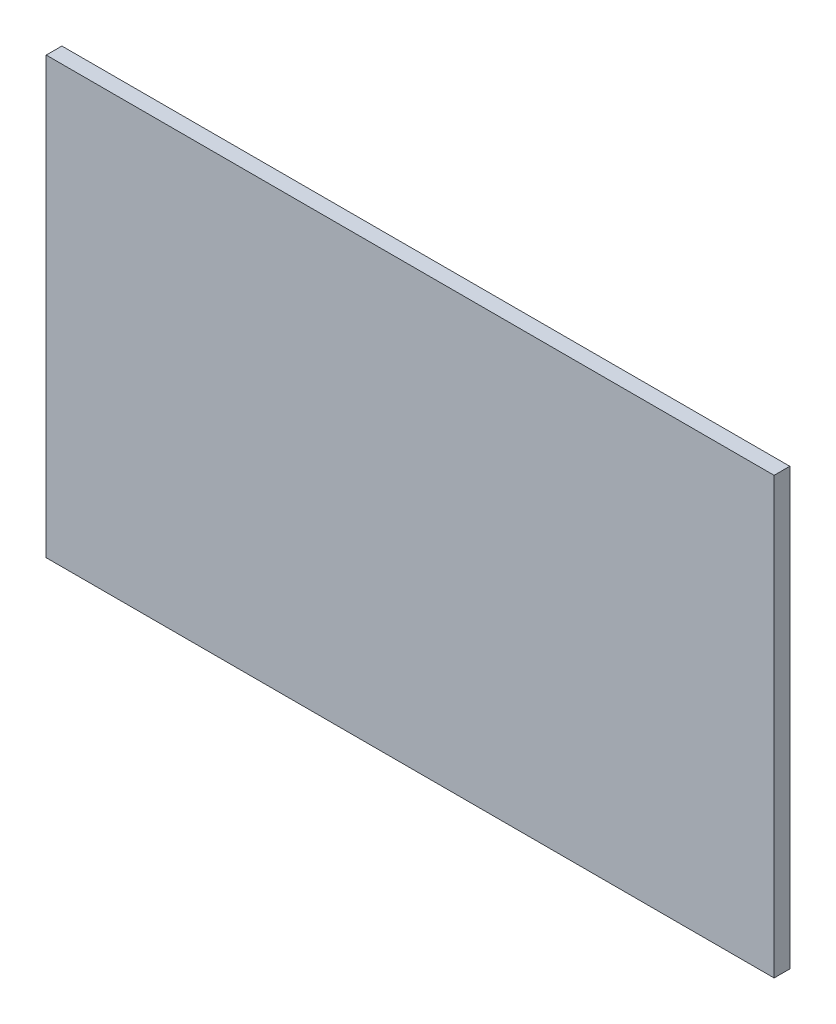
ISO-10303-21;
HEADER;
FILE_DESCRIPTION(('STEP AP214'),'2;1');
FILE_NAME('part.step','',(''),(''),'','','');
FILE_SCHEMA(('AUTOMOTIVE_DESIGN { 1 0 10303 214 1 1 1 1 }'));
ENDSEC;
DATA;
#1=APPLICATION_CONTEXT('core data for automotive mechanical design processes');
#2=APPLICATION_PROTOCOL_DEFINITION('international standard','automotive_design',2000,#1);
#3=PRODUCT_CONTEXT('',#1,'mechanical');
#4=PRODUCT('Part','Part','',(#3));
#5=PRODUCT_RELATED_PRODUCT_CATEGORY('part','',(#4));
#6=PRODUCT_DEFINITION_FORMATION('','',#4);
#7=PRODUCT_DEFINITION_CONTEXT('part definition',#1,'design');
#8=PRODUCT_DEFINITION('design','',#6,#7);
#9=PRODUCT_DEFINITION_SHAPE('','',#8);
#10=(LENGTH_UNIT() NAMED_UNIT(*) SI_UNIT(.MILLI.,.METRE.));
#11=(NAMED_UNIT(*) PLANE_ANGLE_UNIT() SI_UNIT($,.RADIAN.));
#12=(NAMED_UNIT(*) SI_UNIT($,.STERADIAN.) SOLID_ANGLE_UNIT());
#13=UNCERTAINTY_MEASURE_WITH_UNIT(LENGTH_MEASURE(1.E-05),#10,'distance_accuracy_value','');
#14=(GEOMETRIC_REPRESENTATION_CONTEXT(3) GLOBAL_UNCERTAINTY_ASSIGNED_CONTEXT((#13)) GLOBAL_UNIT_ASSIGNED_CONTEXT((#10,
#11,#12)) REPRESENTATION_CONTEXT('',''));
#15=CARTESIAN_POINT('',(0.,0.,0.));
#16=DIRECTION('',(0.,0.,1.));
#17=DIRECTION('',(1.,0.,0.));
#18=AXIS2_PLACEMENT_3D('',#15,#16,#17);
#19=CARTESIAN_POINT('',(0.,0.,9.));
#20=DIRECTION('',(1.,0.,0.));
#21=DIRECTION('',(0.,0.,-1.));
#22=AXIS2_PLACEMENT_3D('',#19,#20,#21);
#23=PLANE('',#22);
#24=DIRECTION('',(0.,-1.,0.));
#25=VECTOR('',#24,1.);
#26=CARTESIAN_POINT('',(0.,0.,0.));
#27=LINE('',#26,#25);
#28=CARTESIAN_POINT('',(0.,250.,0.));
#29=VERTEX_POINT('',#28);
#30=CARTESIAN_POINT('',(0.,0.,0.));
#31=VERTEX_POINT('',#30);
#32=EDGE_CURVE('E96',#29,#31,#27,.T.);
#33=ORIENTED_EDGE('',*,*,#32,.T.);
#34=DIRECTION('',(0.,0.,-1.));
#35=VECTOR('',#34,1.);
#36=CARTESIAN_POINT('',(0.,0.,9.));
#37=LINE('',#36,#35);
#38=CARTESIAN_POINT('',(0.,0.,9.));
#39=VERTEX_POINT('',#38);
#40=EDGE_CURVE('E11',#39,#31,#37,.T.);
#41=ORIENTED_EDGE('',*,*,#40,.F.);
#42=DIRECTION('',(0.,-1.,0.));
#43=VECTOR('',#42,1.);
#44=CARTESIAN_POINT('',(0.,0.,9.));
#45=LINE('',#44,#43);
#46=CARTESIAN_POINT('',(0.,250.,9.));
#47=VERTEX_POINT('',#46);
#48=EDGE_CURVE('E84',#47,#39,#45,.T.);
#49=ORIENTED_EDGE('',*,*,#48,.F.);
#50=DIRECTION('',(0.,0.,-1.));
#51=VECTOR('',#50,1.);
#52=CARTESIAN_POINT('',(0.,250.,9.));
#53=LINE('',#52,#51);
#54=EDGE_CURVE('E92',#47,#29,#53,.T.);
#55=ORIENTED_EDGE('',*,*,#54,.T.);
#56=EDGE_LOOP('',(#33,#41,#49,#55));
#57=FACE_BOUND('',#56,.T.);
#58=ADVANCED_FACE('F33',(#57),#23,.F.);
#59=CARTESIAN_POINT('',(0.,0.,9.));
#60=DIRECTION('',(0.,1.,0.));
#61=DIRECTION('',(0.,0.,1.));
#62=AXIS2_PLACEMENT_3D('',#59,#60,#61);
#63=PLANE('',#62);
#64=DIRECTION('',(1.,0.,0.));
#65=VECTOR('',#64,1.);
#66=CARTESIAN_POINT('',(0.,0.,0.));
#67=LINE('',#66,#65);
#68=CARTESIAN_POINT('',(418.,0.,0.));
#69=VERTEX_POINT('',#68);
#70=EDGE_CURVE('E88',#31,#69,#67,.T.);
#71=ORIENTED_EDGE('',*,*,#70,.T.);
#72=DIRECTION('',(0.,0.,-1.));
#73=VECTOR('',#72,1.);
#74=CARTESIAN_POINT('',(418.,0.,9.));
#75=LINE('',#74,#73);
#76=CARTESIAN_POINT('',(418.,0.,9.));
#77=VERTEX_POINT('',#76);
#78=EDGE_CURVE('E41',#77,#69,#75,.T.);
#79=ORIENTED_EDGE('',*,*,#78,.F.);
#80=DIRECTION('',(1.,0.,0.));
#81=VECTOR('',#80,1.);
#82=CARTESIAN_POINT('',(0.,0.,9.));
#83=LINE('',#82,#81);
#84=EDGE_CURVE('E79',#39,#77,#83,.T.);
#85=ORIENTED_EDGE('',*,*,#84,.F.);
#86=ORIENTED_EDGE('',*,*,#40,.T.);
#87=EDGE_LOOP('',(#71,#79,#85,#86));
#88=FACE_BOUND('',#87,.T.);
#89=ADVANCED_FACE('F87',(#88),#63,.F.);
#90=CARTESIAN_POINT('',(418.,0.,9.));
#91=DIRECTION('',(-1.,0.,0.));
#92=DIRECTION('',(0.,0.,1.));
#93=AXIS2_PLACEMENT_3D('',#90,#91,#92);
#94=PLANE('',#93);
#95=DIRECTION('',(0.,1.,0.));
#96=VECTOR('',#95,1.);
#97=CARTESIAN_POINT('',(418.,0.,0.));
#98=LINE('',#97,#96);
#99=CARTESIAN_POINT('',(418.,250.,0.));
#100=VERTEX_POINT('',#99);
#101=EDGE_CURVE('E66',#69,#100,#98,.T.);
#102=ORIENTED_EDGE('',*,*,#101,.T.);
#103=DIRECTION('',(0.,0.,-1.));
#104=VECTOR('',#103,1.);
#105=CARTESIAN_POINT('',(418.,250.,9.));
#106=LINE('',#105,#104);
#107=CARTESIAN_POINT('',(418.,250.,9.));
#108=VERTEX_POINT('',#107);
#109=EDGE_CURVE('E89',#108,#100,#106,.T.);
#110=ORIENTED_EDGE('',*,*,#109,.F.);
#111=DIRECTION('',(0.,1.,0.));
#112=VECTOR('',#111,1.);
#113=CARTESIAN_POINT('',(418.,0.,9.));
#114=LINE('',#113,#112);
#115=EDGE_CURVE('E82',#77,#108,#114,.T.);
#116=ORIENTED_EDGE('',*,*,#115,.F.);
#117=ORIENTED_EDGE('',*,*,#78,.T.);
#118=EDGE_LOOP('',(#102,#110,#116,#117));
#119=FACE_BOUND('',#118,.T.);
#120=ADVANCED_FACE('F90',(#119),#94,.F.);
#121=CARTESIAN_POINT('',(0.,250.,9.));
#122=DIRECTION('',(0.,-1.,0.));
#123=DIRECTION('',(0.,0.,-1.));
#124=AXIS2_PLACEMENT_3D('',#121,#122,#123);
#125=PLANE('',#124);
#126=DIRECTION('',(-1.,0.,0.));
#127=VECTOR('',#126,1.);
#128=CARTESIAN_POINT('',(0.,250.,0.));
#129=LINE('',#128,#127);
#130=EDGE_CURVE('E72',#100,#29,#129,.T.);
#131=ORIENTED_EDGE('',*,*,#130,.T.);
#132=ORIENTED_EDGE('',*,*,#54,.F.);
#133=DIRECTION('',(-1.,0.,0.));
#134=VECTOR('',#133,1.);
#135=CARTESIAN_POINT('',(0.,250.,9.));
#136=LINE('',#135,#134);
#137=EDGE_CURVE('E49',#108,#47,#136,.T.);
#138=ORIENTED_EDGE('',*,*,#137,.F.);
#139=ORIENTED_EDGE('',*,*,#109,.T.);
#140=EDGE_LOOP('',(#131,#132,#138,#139));
#141=FACE_BOUND('',#140,.T.);
#142=ADVANCED_FACE('F103',(#141),#125,.F.);
#143=CARTESIAN_POINT('',(0.,0.,9.));
#144=DIRECTION('',(0.,0.,-1.));
#145=DIRECTION('',(-1.,0.,0.));
#146=AXIS2_PLACEMENT_3D('',#143,#144,#145);
#147=PLANE('',#146);
#148=ORIENTED_EDGE('',*,*,#48,.T.);
#149=ORIENTED_EDGE('',*,*,#84,.T.);
#150=ORIENTED_EDGE('',*,*,#115,.T.);
#151=ORIENTED_EDGE('',*,*,#137,.T.);
#152=EDGE_LOOP('',(#148,#149,#150,#151));
#153=FACE_BOUND('',#152,.T.);
#154=ADVANCED_FACE('F80',(#153),#147,.F.);
#155=CARTESIAN_POINT('',(0.,0.,0.));
#156=DIRECTION('',(0.,0.,-1.));
#157=DIRECTION('',(-1.,0.,0.));
#158=AXIS2_PLACEMENT_3D('',#155,#156,#157);
#159=PLANE('',#158);
#160=ORIENTED_EDGE('',*,*,#32,.F.);
#161=ORIENTED_EDGE('',*,*,#130,.F.);
#162=ORIENTED_EDGE('',*,*,#101,.F.);
#163=ORIENTED_EDGE('',*,*,#70,.F.);
#164=EDGE_LOOP('',(#160,#161,#162,#163));
#165=FACE_BOUND('',#164,.T.);
#166=ADVANCED_FACE('F106',(#165),#159,.T.);
#167=CLOSED_SHELL('',(#58,#89,#120,#142,#154,#166));
#168=MANIFOLD_SOLID_BREP('B2',#167);
#169=ADVANCED_BREP_SHAPE_REPRESENTATION('',(#18,#168),#14);
#170=SHAPE_DEFINITION_REPRESENTATION(#9,#169);
ENDSEC;
END-ISO-10303-21;
